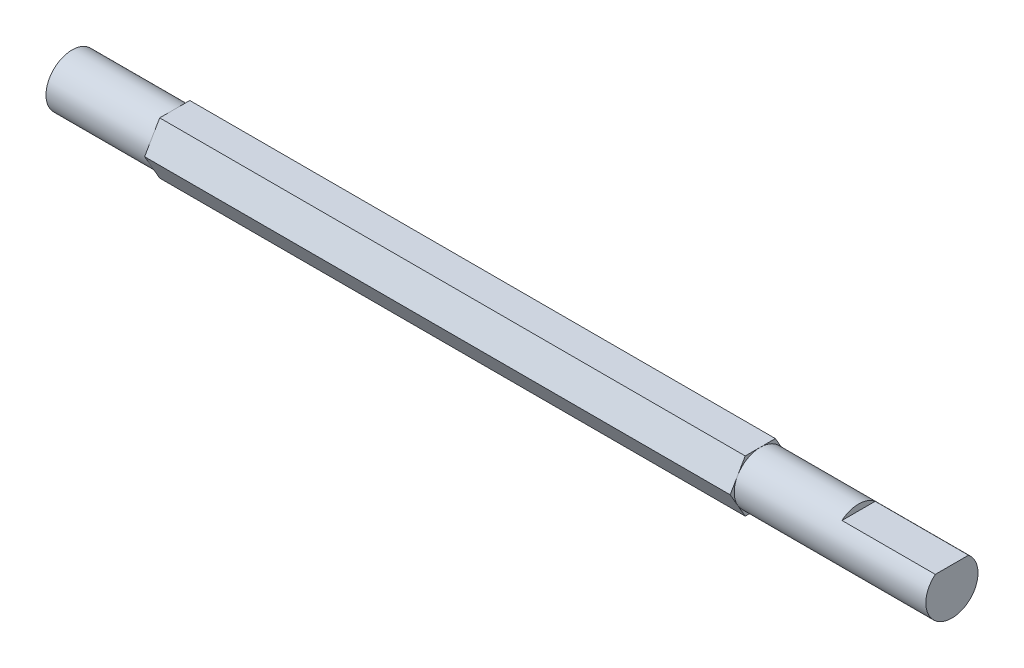
ISO-10303-21;
HEADER;
FILE_DESCRIPTION(('STEP AP214'),'2;1');
FILE_NAME('part.step','',(''),(''),'','','');
FILE_SCHEMA(('AUTOMOTIVE_DESIGN { 1 0 10303 214 1 1 1 1 }'));
ENDSEC;
DATA;
#1=APPLICATION_CONTEXT('core data for automotive mechanical design processes');
#2=APPLICATION_PROTOCOL_DEFINITION('international standard','automotive_design',2000,#1);
#3=PRODUCT_CONTEXT('',#1,'mechanical');
#4=PRODUCT('Part','Part','',(#3));
#5=PRODUCT_RELATED_PRODUCT_CATEGORY('part','',(#4));
#6=PRODUCT_DEFINITION_FORMATION('','',#4);
#7=PRODUCT_DEFINITION_CONTEXT('part definition',#1,'design');
#8=PRODUCT_DEFINITION('design','',#6,#7);
#9=PRODUCT_DEFINITION_SHAPE('','',#8);
#10=(LENGTH_UNIT() NAMED_UNIT(*) SI_UNIT(.MILLI.,.METRE.));
#11=(NAMED_UNIT(*) PLANE_ANGLE_UNIT() SI_UNIT($,.RADIAN.));
#12=(NAMED_UNIT(*) SI_UNIT($,.STERADIAN.) SOLID_ANGLE_UNIT());
#13=UNCERTAINTY_MEASURE_WITH_UNIT(LENGTH_MEASURE(1.E-05),#10,'distance_accuracy_value','');
#14=(GEOMETRIC_REPRESENTATION_CONTEXT(3) GLOBAL_UNCERTAINTY_ASSIGNED_CONTEXT((#13)) GLOBAL_UNIT_ASSIGNED_CONTEXT((#10,
#11,#12)) REPRESENTATION_CONTEXT('',''));
#15=CARTESIAN_POINT('',(0.,0.,0.));
#16=DIRECTION('',(0.,0.,1.));
#17=DIRECTION('',(1.,0.,0.));
#18=AXIS2_PLACEMENT_3D('',#15,#16,#17);
#19=CARTESIAN_POINT('',(94.27,0.,0.));
#20=DIRECTION('',(-1.,0.,0.));
#21=DIRECTION('',(0.,0.,1.));
#22=AXIS2_PLACEMENT_3D('',#19,#20,#21);
#23=CYLINDRICAL_SURFACE('',#22,2.795);
#24=CARTESIAN_POINT('',(73.74,0.,0.));
#25=DIRECTION('',(1.,0.,0.));
#26=DIRECTION('',(0.,0.,-1.));
#27=AXIS2_PLACEMENT_3D('',#24,#25,#26);
#28=CIRCLE('',#27,2.795);
#29=CARTESIAN_POINT('',(73.74,-1.39750000000001,-2.4205410035775));
#30=VERTEX_POINT('',#29);
#31=CARTESIAN_POINT('',(73.74,1.39750000000001,-2.4205410035775));
#32=VERTEX_POINT('',#31);
#33=EDGE_CURVE('E36',#30,#32,#28,.T.);
#34=ORIENTED_EDGE('',*,*,#33,.T.);
#35=CARTESIAN_POINT('',(73.74,2.795,0.));
#36=VERTEX_POINT('',#35);
#37=EDGE_CURVE('E11',#32,#36,#28,.T.);
#38=ORIENTED_EDGE('',*,*,#37,.T.);
#39=CARTESIAN_POINT('',(73.74,1.39749999999999,2.42054100357751));
#40=VERTEX_POINT('',#39);
#41=EDGE_CURVE('E41',#36,#40,#28,.T.);
#42=ORIENTED_EDGE('',*,*,#41,.T.);
#43=CARTESIAN_POINT('',(73.74,-1.39749999999999,2.42054100357751));
#44=VERTEX_POINT('',#43);
#45=EDGE_CURVE('E295',#40,#44,#28,.T.);
#46=ORIENTED_EDGE('',*,*,#45,.T.);
#47=CARTESIAN_POINT('',(73.74,-2.795,0.));
#48=VERTEX_POINT('',#47);
#49=EDGE_CURVE('E290',#44,#48,#28,.T.);
#50=ORIENTED_EDGE('',*,*,#49,.T.);
#51=EDGE_CURVE('E235',#48,#30,#28,.T.);
#52=ORIENTED_EDGE('',*,*,#51,.T.);
#53=EDGE_LOOP('',(#34,#38,#42,#46,#50,#52));
#54=FACE_BOUND('',#53,.T.);
#55=DIRECTION('',(1.,0.,0.));
#56=VECTOR('',#55,1.);
#57=CARTESIAN_POINT('',(84.27,2.155,-1.77988763690296));
#58=LINE('',#57,#56);
#59=CARTESIAN_POINT('',(84.27,2.155,-1.77988763690296));
#60=VERTEX_POINT('',#59);
#61=CARTESIAN_POINT('',(94.27,2.155,-1.77988763690296));
#62=VERTEX_POINT('',#61);
#63=EDGE_CURVE('E136',#60,#62,#58,.T.);
#64=ORIENTED_EDGE('',*,*,#63,.T.);
#65=CARTESIAN_POINT('',(94.27,0.,0.));
#66=DIRECTION('',(1.,0.,0.));
#67=DIRECTION('',(0.,0.,-1.));
#68=AXIS2_PLACEMENT_3D('',#65,#66,#67);
#69=CIRCLE('',#68,2.795);
#70=CARTESIAN_POINT('',(94.27,2.155,1.77988763690296));
#71=VERTEX_POINT('',#70);
#72=EDGE_CURVE('E147',#71,#62,#69,.T.);
#73=ORIENTED_EDGE('',*,*,#72,.F.);
#74=DIRECTION('',(1.,0.,0.));
#75=VECTOR('',#74,1.);
#76=CARTESIAN_POINT('',(84.27,2.155,1.77988763690296));
#77=LINE('',#76,#75);
#78=CARTESIAN_POINT('',(84.27,2.155,1.77988763690296));
#79=VERTEX_POINT('',#78);
#80=EDGE_CURVE('E48',#79,#71,#77,.T.);
#81=ORIENTED_EDGE('',*,*,#80,.F.);
#82=CARTESIAN_POINT('',(84.27,0.,0.));
#83=DIRECTION('',(1.,0.,0.));
#84=DIRECTION('',(0.,0.,-1.));
#85=AXIS2_PLACEMENT_3D('',#82,#83,#84);
#86=CIRCLE('',#85,2.795);
#87=EDGE_CURVE('E139',#60,#79,#86,.T.);
#88=ORIENTED_EDGE('',*,*,#87,.F.);
#89=EDGE_LOOP('',(#64,#73,#81,#88));
#90=FACE_BOUND('',#89,.T.);
#91=ADVANCED_FACE('F33',(#54,#90),#23,.T.);
#92=CARTESIAN_POINT('',(94.27,0.,0.));
#93=DIRECTION('',(1.,0.,0.));
#94=DIRECTION('',(0.,0.,-1.));
#95=AXIS2_PLACEMENT_3D('',#92,#93,#94);
#96=PLANE('',#95);
#97=ORIENTED_EDGE('',*,*,#72,.T.);
#98=DIRECTION('',(0.,0.,1.));
#99=VECTOR('',#98,1.);
#100=CARTESIAN_POINT('',(94.27,2.155,0.));
#101=LINE('',#100,#99);
#102=EDGE_CURVE('E143',#62,#71,#101,.T.);
#103=ORIENTED_EDGE('',*,*,#102,.T.);
#104=EDGE_LOOP('',(#97,#103));
#105=FACE_BOUND('',#104,.T.);
#106=ADVANCED_FACE('F313',(#105),#96,.T.);
#107=CARTESIAN_POINT('',(73.74,2.795,-1.61369400238499));
#108=DIRECTION('',(0.,-0.500000000000004,0.866025403784436));
#109=DIRECTION('',(0.,-0.866025403784436,-0.500000000000004));
#110=AXIS2_PLACEMENT_3D('',#107,#108,#109);
#111=PLANE('',#110);
#112=DIRECTION('',(0.,0.866025403784436,0.500000000000004));
#113=VECTOR('',#112,1.);
#114=CARTESIAN_POINT('',(73.74,2.795,-1.61369400238499));
#115=LINE('',#114,#113);
#116=CARTESIAN_POINT('',(73.74,2.795,-1.61369400238499));
#117=VERTEX_POINT('',#116);
#118=EDGE_CURVE('E155',#32,#117,#115,.T.);
#119=ORIENTED_EDGE('',*,*,#118,.F.);
#120=CARTESIAN_POINT('',(73.74,0.,-3.22738800477002));
#121=VERTEX_POINT('',#120);
#122=EDGE_CURVE('E56',#121,#32,#115,.T.);
#123=ORIENTED_EDGE('',*,*,#122,.F.);
#124=DIRECTION('',(-1.,0.,0.));
#125=VECTOR('',#124,1.);
#126=CARTESIAN_POINT('',(73.74,0.,-3.22738800477002));
#127=LINE('',#126,#125);
#128=CARTESIAN_POINT('',(11.,0.,-3.22738800477002));
#129=VERTEX_POINT('',#128);
#130=EDGE_CURVE('E175',#121,#129,#127,.T.);
#131=ORIENTED_EDGE('',*,*,#130,.T.);
#132=DIRECTION('',(0.,0.866025403784436,0.500000000000004));
#133=VECTOR('',#132,1.);
#134=CARTESIAN_POINT('',(11.,2.795,-1.61369400238499));
#135=LINE('',#134,#133);
#136=CARTESIAN_POINT('',(11.,1.39750000000001,-2.4205410035775));
#137=VERTEX_POINT('',#136);
#138=EDGE_CURVE('E176',#129,#137,#135,.T.);
#139=ORIENTED_EDGE('',*,*,#138,.T.);
#140=CARTESIAN_POINT('',(11.,2.795,-1.61369400238499));
#141=VERTEX_POINT('',#140);
#142=EDGE_CURVE('E149',#137,#141,#135,.T.);
#143=ORIENTED_EDGE('',*,*,#142,.T.);
#144=DIRECTION('',(-1.,0.,0.));
#145=VECTOR('',#144,1.);
#146=CARTESIAN_POINT('',(73.74,2.795,-1.61369400238499));
#147=LINE('',#146,#145);
#148=EDGE_CURVE('E213',#117,#141,#147,.T.);
#149=ORIENTED_EDGE('',*,*,#148,.F.);
#150=EDGE_LOOP('',(#119,#123,#131,#139,#143,#149));
#151=FACE_BOUND('',#150,.T.);
#152=ADVANCED_FACE('F279',(#151),#111,.F.);
#153=CARTESIAN_POINT('',(73.74,2.795,-1.61369400238499));
#154=DIRECTION('',(0.,-1.,0.));
#155=DIRECTION('',(0.,0.,-1.));
#156=AXIS2_PLACEMENT_3D('',#153,#154,#155);
#157=PLANE('',#156);
#158=DIRECTION('',(0.,0.,1.));
#159=VECTOR('',#158,1.);
#160=CARTESIAN_POINT('',(73.74,2.795,-1.61369400238499));
#161=LINE('',#160,#159);
#162=CARTESIAN_POINT('',(73.74,2.795,1.61369400238501));
#163=VERTEX_POINT('',#162);
#164=EDGE_CURVE('E154',#36,#163,#161,.T.);
#165=ORIENTED_EDGE('',*,*,#164,.F.);
#166=EDGE_CURVE('E156',#117,#36,#161,.T.);
#167=ORIENTED_EDGE('',*,*,#166,.F.);
#168=ORIENTED_EDGE('',*,*,#148,.T.);
#169=DIRECTION('',(0.,0.,1.));
#170=VECTOR('',#169,1.);
#171=CARTESIAN_POINT('',(11.,2.795,-1.61369400238499));
#172=LINE('',#171,#170);
#173=CARTESIAN_POINT('',(11.,2.795,0.));
#174=VERTEX_POINT('',#173);
#175=EDGE_CURVE('E180',#141,#174,#172,.T.);
#176=ORIENTED_EDGE('',*,*,#175,.T.);
#177=CARTESIAN_POINT('',(11.,2.795,1.61369400238501));
#178=VERTEX_POINT('',#177);
#179=EDGE_CURVE('E179',#174,#178,#172,.T.);
#180=ORIENTED_EDGE('',*,*,#179,.T.);
#181=DIRECTION('',(-1.,0.,0.));
#182=VECTOR('',#181,1.);
#183=CARTESIAN_POINT('',(73.74,2.795,1.61369400238501));
#184=LINE('',#183,#182);
#185=EDGE_CURVE('E210',#163,#178,#184,.T.);
#186=ORIENTED_EDGE('',*,*,#185,.F.);
#187=EDGE_LOOP('',(#165,#167,#168,#176,#180,#186));
#188=FACE_BOUND('',#187,.T.);
#189=ADVANCED_FACE('F274',(#188),#157,.F.);
#190=CARTESIAN_POINT('',(73.74,2.795,1.61369400238501));
#191=DIRECTION('',(0.,-0.499999999999998,-0.86602540378444));
#192=DIRECTION('',(0.,0.86602540378444,-0.499999999999998));
#193=AXIS2_PLACEMENT_3D('',#190,#191,#192);
#194=PLANE('',#193);
#195=DIRECTION('',(0.,-0.86602540378444,0.499999999999998));
#196=VECTOR('',#195,1.);
#197=CARTESIAN_POINT('',(73.74,2.795,1.61369400238501));
#198=LINE('',#197,#196);
#199=CARTESIAN_POINT('',(73.74,0.,3.22738800477));
#200=VERTEX_POINT('',#199);
#201=EDGE_CURVE('E159',#40,#200,#198,.T.);
#202=ORIENTED_EDGE('',*,*,#201,.F.);
#203=EDGE_CURVE('E160',#163,#40,#198,.T.);
#204=ORIENTED_EDGE('',*,*,#203,.F.);
#205=ORIENTED_EDGE('',*,*,#185,.T.);
#206=DIRECTION('',(0.,-0.86602540378444,0.499999999999998));
#207=VECTOR('',#206,1.);
#208=CARTESIAN_POINT('',(11.,2.795,1.61369400238501));
#209=LINE('',#208,#207);
#210=CARTESIAN_POINT('',(11.,1.39749999999999,2.42054100357751));
#211=VERTEX_POINT('',#210);
#212=EDGE_CURVE('E184',#178,#211,#209,.T.);
#213=ORIENTED_EDGE('',*,*,#212,.T.);
#214=CARTESIAN_POINT('',(11.,0.,3.22738800477));
#215=VERTEX_POINT('',#214);
#216=EDGE_CURVE('E183',#211,#215,#209,.T.);
#217=ORIENTED_EDGE('',*,*,#216,.T.);
#218=DIRECTION('',(-1.,0.,0.));
#219=VECTOR('',#218,1.);
#220=CARTESIAN_POINT('',(73.74,0.,3.22738800477));
#221=LINE('',#220,#219);
#222=EDGE_CURVE('E207',#200,#215,#221,.T.);
#223=ORIENTED_EDGE('',*,*,#222,.F.);
#224=EDGE_LOOP('',(#202,#204,#205,#213,#217,#223));
#225=FACE_BOUND('',#224,.T.);
#226=ADVANCED_FACE('F268',(#225),#194,.F.);
#227=CARTESIAN_POINT('',(73.74,-2.795,1.61369400238501));
#228=DIRECTION('',(0.,0.499999999999998,-0.86602540378444));
#229=DIRECTION('',(0.,0.86602540378444,0.499999999999998));
#230=AXIS2_PLACEMENT_3D('',#227,#228,#229);
#231=PLANE('',#230);
#232=DIRECTION('',(0.,-0.86602540378444,-0.499999999999998));
#233=VECTOR('',#232,1.);
#234=CARTESIAN_POINT('',(73.74,-2.795,1.61369400238501));
#235=LINE('',#234,#233);
#236=CARTESIAN_POINT('',(73.74,-2.795,1.61369400238501));
#237=VERTEX_POINT('',#236);
#238=EDGE_CURVE('E163',#44,#237,#235,.T.);
#239=ORIENTED_EDGE('',*,*,#238,.F.);
#240=EDGE_CURVE('E164',#200,#44,#235,.T.);
#241=ORIENTED_EDGE('',*,*,#240,.F.);
#242=ORIENTED_EDGE('',*,*,#222,.T.);
#243=DIRECTION('',(0.,-0.86602540378444,-0.499999999999998));
#244=VECTOR('',#243,1.);
#245=CARTESIAN_POINT('',(11.,-2.795,1.61369400238501));
#246=LINE('',#245,#244);
#247=CARTESIAN_POINT('',(11.,-1.39749999999999,2.42054100357751));
#248=VERTEX_POINT('',#247);
#249=EDGE_CURVE('E188',#215,#248,#246,.T.);
#250=ORIENTED_EDGE('',*,*,#249,.T.);
#251=CARTESIAN_POINT('',(11.,-2.795,1.61369400238501));
#252=VERTEX_POINT('',#251);
#253=EDGE_CURVE('E187',#248,#252,#246,.T.);
#254=ORIENTED_EDGE('',*,*,#253,.T.);
#255=DIRECTION('',(-1.,0.,0.));
#256=VECTOR('',#255,1.);
#257=CARTESIAN_POINT('',(73.74,-2.795,1.61369400238501));
#258=LINE('',#257,#256);
#259=EDGE_CURVE('E204',#237,#252,#258,.T.);
#260=ORIENTED_EDGE('',*,*,#259,.F.);
#261=EDGE_LOOP('',(#239,#241,#242,#250,#254,#260));
#262=FACE_BOUND('',#261,.T.);
#263=ADVANCED_FACE('F262',(#262),#231,.F.);
#264=CARTESIAN_POINT('',(73.74,-2.795,-1.613694002385));
#265=DIRECTION('',(0.,1.,0.));
#266=DIRECTION('',(0.,0.,1.));
#267=AXIS2_PLACEMENT_3D('',#264,#265,#266);
#268=PLANE('',#267);
#269=DIRECTION('',(0.,0.,-1.));
#270=VECTOR('',#269,1.);
#271=CARTESIAN_POINT('',(73.74,-2.795,-1.613694002385));
#272=LINE('',#271,#270);
#273=CARTESIAN_POINT('',(73.74,-2.795,-1.613694002385));
#274=VERTEX_POINT('',#273);
#275=EDGE_CURVE('E167',#48,#274,#272,.T.);
#276=ORIENTED_EDGE('',*,*,#275,.F.);
#277=EDGE_CURVE('E168',#237,#48,#272,.T.);
#278=ORIENTED_EDGE('',*,*,#277,.F.);
#279=ORIENTED_EDGE('',*,*,#259,.T.);
#280=DIRECTION('',(0.,0.,-1.));
#281=VECTOR('',#280,1.);
#282=CARTESIAN_POINT('',(11.,-2.795,-1.613694002385));
#283=LINE('',#282,#281);
#284=CARTESIAN_POINT('',(11.,-2.795,0.));
#285=VERTEX_POINT('',#284);
#286=EDGE_CURVE('E192',#252,#285,#283,.T.);
#287=ORIENTED_EDGE('',*,*,#286,.T.);
#288=CARTESIAN_POINT('',(11.,-2.795,-1.613694002385));
#289=VERTEX_POINT('',#288);
#290=EDGE_CURVE('E191',#285,#289,#283,.T.);
#291=ORIENTED_EDGE('',*,*,#290,.T.);
#292=DIRECTION('',(-1.,0.,0.));
#293=VECTOR('',#292,1.);
#294=CARTESIAN_POINT('',(73.74,-2.795,-1.613694002385));
#295=LINE('',#294,#293);
#296=EDGE_CURVE('E201',#274,#289,#295,.T.);
#297=ORIENTED_EDGE('',*,*,#296,.F.);
#298=EDGE_LOOP('',(#276,#278,#279,#287,#291,#297));
#299=FACE_BOUND('',#298,.T.);
#300=ADVANCED_FACE('F257',(#299),#268,.F.);
#301=CARTESIAN_POINT('',(73.74,-2.795,-1.613694002385));
#302=DIRECTION('',(0.,0.500000000000004,0.866025403784437));
#303=DIRECTION('',(0.,-0.866025403784437,0.500000000000004));
#304=AXIS2_PLACEMENT_3D('',#301,#302,#303);
#305=PLANE('',#304);
#306=DIRECTION('',(0.,0.866025403784436,-0.500000000000004));
#307=VECTOR('',#306,1.);
#308=CARTESIAN_POINT('',(73.74,-2.795,-1.613694002385));
#309=LINE('',#308,#307);
#310=EDGE_CURVE('E171',#30,#121,#309,.T.);
#311=ORIENTED_EDGE('',*,*,#310,.F.);
#312=EDGE_CURVE('E172',#274,#30,#309,.T.);
#313=ORIENTED_EDGE('',*,*,#312,.F.);
#314=ORIENTED_EDGE('',*,*,#296,.T.);
#315=DIRECTION('',(0.,0.866025403784436,-0.500000000000004));
#316=VECTOR('',#315,1.);
#317=CARTESIAN_POINT('',(11.,-2.795,-1.613694002385));
#318=LINE('',#317,#316);
#319=CARTESIAN_POINT('',(11.,-1.39750000000001,-2.4205410035775));
#320=VERTEX_POINT('',#319);
#321=EDGE_CURVE('E196',#289,#320,#318,.T.);
#322=ORIENTED_EDGE('',*,*,#321,.T.);
#323=EDGE_CURVE('E195',#320,#129,#318,.T.);
#324=ORIENTED_EDGE('',*,*,#323,.T.);
#325=ORIENTED_EDGE('',*,*,#130,.F.);
#326=EDGE_LOOP('',(#311,#313,#314,#322,#324,#325));
#327=FACE_BOUND('',#326,.T.);
#328=ADVANCED_FACE('F284',(#327),#305,.F.);
#329=CARTESIAN_POINT('',(73.74,0.,0.));
#330=DIRECTION('',(1.,0.,0.));
#331=DIRECTION('',(0.,0.,-1.));
#332=AXIS2_PLACEMENT_3D('',#329,#330,#331);
#333=PLANE('',#332);
#334=ORIENTED_EDGE('',*,*,#37,.F.);
#335=ORIENTED_EDGE('',*,*,#118,.T.);
#336=ORIENTED_EDGE('',*,*,#166,.T.);
#337=EDGE_LOOP('',(#334,#335,#336));
#338=FACE_BOUND('',#337,.T.);
#339=ADVANCED_FACE('F300',(#338),#333,.T.);
#340=ORIENTED_EDGE('',*,*,#41,.F.);
#341=ORIENTED_EDGE('',*,*,#164,.T.);
#342=ORIENTED_EDGE('',*,*,#203,.T.);
#343=EDGE_LOOP('',(#340,#341,#342));
#344=FACE_BOUND('',#343,.T.);
#345=ADVANCED_FACE('F298',(#344),#333,.T.);
#346=ORIENTED_EDGE('',*,*,#45,.F.);
#347=ORIENTED_EDGE('',*,*,#201,.T.);
#348=ORIENTED_EDGE('',*,*,#240,.T.);
#349=EDGE_LOOP('',(#346,#347,#348));
#350=FACE_BOUND('',#349,.T.);
#351=ADVANCED_FACE('F309',(#350),#333,.T.);
#352=ORIENTED_EDGE('',*,*,#49,.F.);
#353=ORIENTED_EDGE('',*,*,#238,.T.);
#354=ORIENTED_EDGE('',*,*,#277,.T.);
#355=EDGE_LOOP('',(#352,#353,#354));
#356=FACE_BOUND('',#355,.T.);
#357=ADVANCED_FACE('F289',(#356),#333,.T.);
#358=ORIENTED_EDGE('',*,*,#51,.F.);
#359=ORIENTED_EDGE('',*,*,#275,.T.);
#360=ORIENTED_EDGE('',*,*,#312,.T.);
#361=EDGE_LOOP('',(#358,#359,#360));
#362=FACE_BOUND('',#361,.T.);
#363=ADVANCED_FACE('F302',(#362),#333,.T.);
#364=ORIENTED_EDGE('',*,*,#33,.F.);
#365=ORIENTED_EDGE('',*,*,#310,.T.);
#366=ORIENTED_EDGE('',*,*,#122,.T.);
#367=EDGE_LOOP('',(#364,#365,#366));
#368=FACE_BOUND('',#367,.T.);
#369=ADVANCED_FACE('F301',(#368),#333,.T.);
#370=CARTESIAN_POINT('',(11.,0.,0.));
#371=DIRECTION('',(1.,0.,0.));
#372=DIRECTION('',(0.,0.,-1.));
#373=AXIS2_PLACEMENT_3D('',#370,#371,#372);
#374=PLANE('',#373);
#375=ORIENTED_EDGE('',*,*,#142,.F.);
#376=CARTESIAN_POINT('',(11.,0.,0.));
#377=DIRECTION('',(1.,0.,0.));
#378=DIRECTION('',(0.,0.,-1.));
#379=AXIS2_PLACEMENT_3D('',#376,#377,#378);
#380=CIRCLE('',#379,2.795);
#381=EDGE_CURVE('E222',#137,#174,#380,.T.);
#382=ORIENTED_EDGE('',*,*,#381,.T.);
#383=ORIENTED_EDGE('',*,*,#175,.F.);
#384=EDGE_LOOP('',(#375,#382,#383));
#385=FACE_BOUND('',#384,.T.);
#386=ADVANCED_FACE('F277',(#385),#374,.F.);
#387=ORIENTED_EDGE('',*,*,#179,.F.);
#388=EDGE_CURVE('E230',#174,#211,#380,.T.);
#389=ORIENTED_EDGE('',*,*,#388,.T.);
#390=ORIENTED_EDGE('',*,*,#212,.F.);
#391=EDGE_LOOP('',(#387,#389,#390));
#392=FACE_BOUND('',#391,.T.);
#393=ADVANCED_FACE('F271',(#392),#374,.F.);
#394=ORIENTED_EDGE('',*,*,#216,.F.);
#395=EDGE_CURVE('E237',#211,#248,#380,.T.);
#396=ORIENTED_EDGE('',*,*,#395,.T.);
#397=ORIENTED_EDGE('',*,*,#249,.F.);
#398=EDGE_LOOP('',(#394,#396,#397));
#399=FACE_BOUND('',#398,.T.);
#400=ADVANCED_FACE('F265',(#399),#374,.F.);
#401=ORIENTED_EDGE('',*,*,#253,.F.);
#402=EDGE_CURVE('E228',#248,#285,#380,.T.);
#403=ORIENTED_EDGE('',*,*,#402,.T.);
#404=ORIENTED_EDGE('',*,*,#286,.F.);
#405=EDGE_LOOP('',(#401,#403,#404));
#406=FACE_BOUND('',#405,.T.);
#407=ADVANCED_FACE('F249',(#406),#374,.F.);
#408=ORIENTED_EDGE('',*,*,#290,.F.);
#409=EDGE_CURVE('E221',#285,#320,#380,.T.);
#410=ORIENTED_EDGE('',*,*,#409,.T.);
#411=ORIENTED_EDGE('',*,*,#321,.F.);
#412=EDGE_LOOP('',(#408,#410,#411));
#413=FACE_BOUND('',#412,.T.);
#414=ADVANCED_FACE('F253',(#413),#374,.F.);
#415=ORIENTED_EDGE('',*,*,#323,.F.);
#416=EDGE_CURVE('E218',#320,#137,#380,.T.);
#417=ORIENTED_EDGE('',*,*,#416,.T.);
#418=ORIENTED_EDGE('',*,*,#138,.F.);
#419=EDGE_LOOP('',(#415,#417,#418));
#420=FACE_BOUND('',#419,.T.);
#421=ADVANCED_FACE('F281',(#420),#374,.F.);
#422=CARTESIAN_POINT('',(0.,0.,0.));
#423=DIRECTION('',(1.,0.,0.));
#424=DIRECTION('',(0.,0.,-1.));
#425=AXIS2_PLACEMENT_3D('',#422,#423,#424);
#426=PLANE('',#425);
#427=CARTESIAN_POINT('',(0.,0.,0.));
#428=DIRECTION('',(1.,0.,0.));
#429=DIRECTION('',(0.,0.,-1.));
#430=AXIS2_PLACEMENT_3D('',#427,#428,#429);
#431=CIRCLE('',#430,2.795);
#432=CARTESIAN_POINT('',(0.,0.,-2.795));
#433=VERTEX_POINT('',#432);
#434=EDGE_CURVE('E216',#433,#433,#431,.T.);
#435=ORIENTED_EDGE('',*,*,#434,.F.);
#436=EDGE_LOOP('',(#435));
#437=FACE_BOUND('',#436,.T.);
#438=ADVANCED_FACE('F321',(#437),#426,.F.);
#439=ORIENTED_EDGE('',*,*,#434,.T.);
#440=EDGE_LOOP('',(#439));
#441=FACE_BOUND('',#440,.T.);
#442=ORIENTED_EDGE('',*,*,#381,.F.);
#443=ORIENTED_EDGE('',*,*,#416,.F.);
#444=ORIENTED_EDGE('',*,*,#409,.F.);
#445=ORIENTED_EDGE('',*,*,#402,.F.);
#446=ORIENTED_EDGE('',*,*,#395,.F.);
#447=ORIENTED_EDGE('',*,*,#388,.F.);
#448=EDGE_LOOP('',(#442,#443,#444,#445,#446,#447));
#449=FACE_BOUND('',#448,.T.);
#450=ADVANCED_FACE('F314',(#441,#449),#23,.T.);
#451=CARTESIAN_POINT('',(84.27,2.155,0.));
#452=DIRECTION('',(0.,1.,0.));
#453=DIRECTION('',(0.,0.,1.));
#454=AXIS2_PLACEMENT_3D('',#451,#452,#453);
#455=PLANE('',#454);
#456=ORIENTED_EDGE('',*,*,#102,.F.);
#457=ORIENTED_EDGE('',*,*,#63,.F.);
#458=DIRECTION('',(0.,0.,1.));
#459=VECTOR('',#458,1.);
#460=CARTESIAN_POINT('',(84.27,2.155,0.));
#461=LINE('',#460,#459);
#462=EDGE_CURVE('E132',#60,#79,#461,.T.);
#463=ORIENTED_EDGE('',*,*,#462,.T.);
#464=ORIENTED_EDGE('',*,*,#80,.T.);
#465=EDGE_LOOP('',(#456,#457,#463,#464));
#466=FACE_BOUND('',#465,.T.);
#467=ADVANCED_FACE('F134',(#466),#455,.T.);
#468=CARTESIAN_POINT('',(84.27,0.,0.));
#469=DIRECTION('',(1.,0.,0.));
#470=DIRECTION('',(0.,0.,-1.));
#471=AXIS2_PLACEMENT_3D('',#468,#469,#470);
#472=PLANE('',#471);
#473=ORIENTED_EDGE('',*,*,#87,.T.);
#474=ORIENTED_EDGE('',*,*,#462,.F.);
#475=EDGE_LOOP('',(#473,#474));
#476=FACE_BOUND('',#475,.T.);
#477=ADVANCED_FACE('F141',(#476),#472,.T.);
#478=CLOSED_SHELL('',(#91,#106,#152,#189,#226,#263,#300,#328,#339,#345,#351,#357,#363,#369,#386,
#393,#400,#407,#414,#421,#438,#450,#467,#477));
#479=MANIFOLD_SOLID_BREP('B2',#478);
#480=ADVANCED_BREP_SHAPE_REPRESENTATION('',(#18,#479),#14);
#481=SHAPE_DEFINITION_REPRESENTATION(#9,#480);
ENDSEC;
END-ISO-10303-21;
